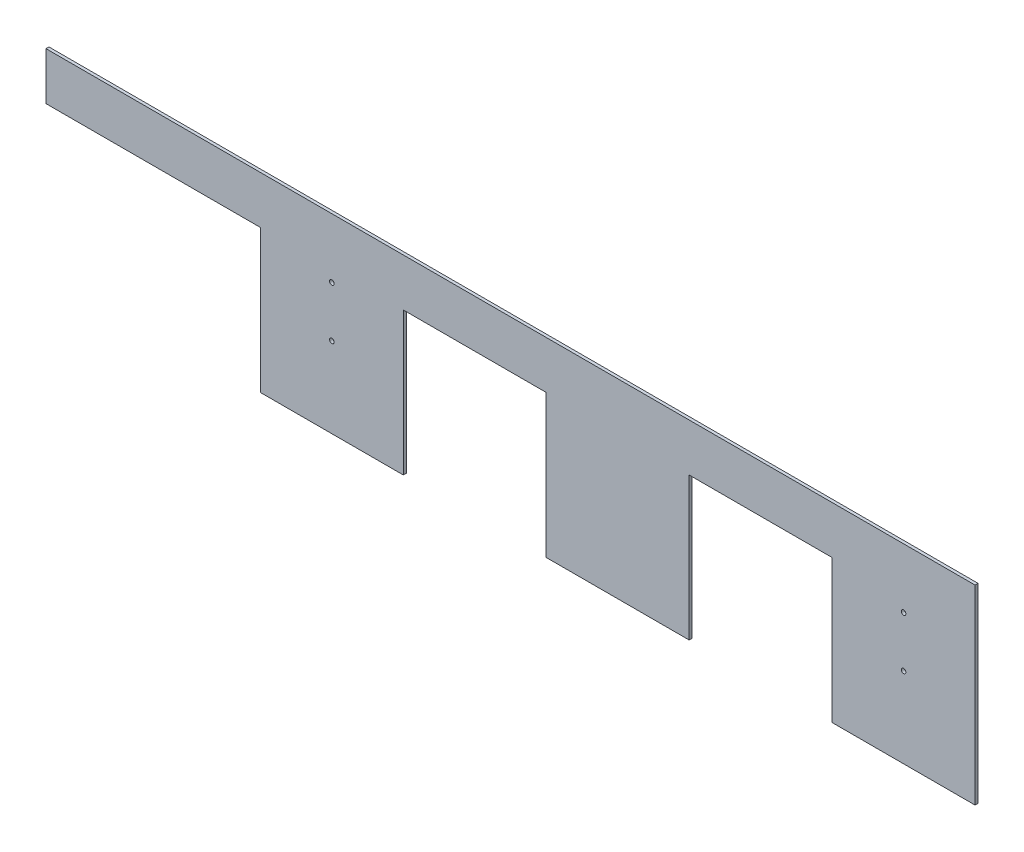
ISO-10303-21;
HEADER;
FILE_DESCRIPTION(('STEP AP214'),'2;1');
FILE_NAME('part.step','',(''),(''),'','','');
FILE_SCHEMA(('AUTOMOTIVE_DESIGN { 1 0 10303 214 1 1 1 1 }'));
ENDSEC;
DATA;
#1=APPLICATION_CONTEXT('core data for automotive mechanical design processes');
#2=APPLICATION_PROTOCOL_DEFINITION('international standard','automotive_design',2000,#1);
#3=PRODUCT_CONTEXT('',#1,'mechanical');
#4=PRODUCT('Part','Part','',(#3));
#5=PRODUCT_RELATED_PRODUCT_CATEGORY('part','',(#4));
#6=PRODUCT_DEFINITION_FORMATION('','',#4);
#7=PRODUCT_DEFINITION_CONTEXT('part definition',#1,'design');
#8=PRODUCT_DEFINITION('design','',#6,#7);
#9=PRODUCT_DEFINITION_SHAPE('','',#8);
#10=(LENGTH_UNIT() NAMED_UNIT(*) SI_UNIT(.MILLI.,.METRE.));
#11=(NAMED_UNIT(*) PLANE_ANGLE_UNIT() SI_UNIT($,.RADIAN.));
#12=(NAMED_UNIT(*) SI_UNIT($,.STERADIAN.) SOLID_ANGLE_UNIT());
#13=UNCERTAINTY_MEASURE_WITH_UNIT(LENGTH_MEASURE(1.E-05),#10,'distance_accuracy_value','');
#14=(GEOMETRIC_REPRESENTATION_CONTEXT(3) GLOBAL_UNCERTAINTY_ASSIGNED_CONTEXT((#13)) GLOBAL_UNIT_ASSIGNED_CONTEXT((#10,
#11,#12)) REPRESENTATION_CONTEXT('',''));
#15=CARTESIAN_POINT('',(0.,0.,0.));
#16=DIRECTION('',(0.,0.,1.));
#17=DIRECTION('',(1.,0.,0.));
#18=AXIS2_PLACEMENT_3D('',#15,#16,#17);
#19=CARTESIAN_POINT('',(0.,0.,3.175));
#20=DIRECTION('',(0.,0.,1.));
#21=DIRECTION('',(1.,0.,0.));
#22=AXIS2_PLACEMENT_3D('',#19,#20,#21);
#23=PLANE('',#22);
#24=CARTESIAN_POINT('',(-190.5,-15.875,3.175));
#25=DIRECTION('',(0.,0.,-1.));
#26=DIRECTION('',(-1.,0.,0.));
#27=AXIS2_PLACEMENT_3D('',#24,#25,#26);
#28=CIRCLE('',#27,2.4384);
#29=CARTESIAN_POINT('',(-192.9384,-15.875,3.175));
#30=VERTEX_POINT('',#29);
#31=EDGE_CURVE('E152',#30,#30,#28,.T.);
#32=ORIENTED_EDGE('',*,*,#31,.T.);
#33=EDGE_LOOP('',(#32));
#34=FACE_BOUND('',#33,.T.);
#35=CARTESIAN_POINT('',(-190.5,38.1,3.175));
#36=DIRECTION('',(0.,0.,-1.));
#37=DIRECTION('',(-1.,0.,0.));
#38=AXIS2_PLACEMENT_3D('',#35,#36,#37);
#39=CIRCLE('',#38,2.4384);
#40=CARTESIAN_POINT('',(-192.9384,38.1,3.175));
#41=VERTEX_POINT('',#40);
#42=EDGE_CURVE('E155',#41,#41,#39,.T.);
#43=ORIENTED_EDGE('',*,*,#42,.T.);
#44=EDGE_LOOP('',(#43));
#45=FACE_BOUND('',#44,.T.);
#46=CARTESIAN_POINT('',(419.1,-15.875,3.175));
#47=DIRECTION('',(0.,0.,-1.));
#48=DIRECTION('',(-1.,0.,0.));
#49=AXIS2_PLACEMENT_3D('',#46,#47,#48);
#50=CIRCLE('',#49,2.4384);
#51=CARTESIAN_POINT('',(416.6616,-15.875,3.175));
#52=VERTEX_POINT('',#51);
#53=EDGE_CURVE('E157',#52,#52,#50,.T.);
#54=ORIENTED_EDGE('',*,*,#53,.T.);
#55=EDGE_LOOP('',(#54));
#56=FACE_BOUND('',#55,.T.);
#57=CARTESIAN_POINT('',(419.1,38.1,3.175));
#58=DIRECTION('',(0.,0.,-1.));
#59=DIRECTION('',(-1.,0.,0.));
#60=AXIS2_PLACEMENT_3D('',#57,#58,#59);
#61=CIRCLE('',#60,2.4384);
#62=CARTESIAN_POINT('',(416.6616,38.1,3.175));
#63=VERTEX_POINT('',#62);
#64=EDGE_CURVE('E20',#63,#63,#61,.T.);
#65=ORIENTED_EDGE('',*,*,#64,.T.);
#66=EDGE_LOOP('',(#65));
#67=FACE_BOUND('',#66,.T.);
#68=DIRECTION('',(0.,1.,0.));
#69=VECTOR('',#68,1.);
#70=CARTESIAN_POINT('',(-495.3,101.6,3.175));
#71=LINE('',#70,#69);
#72=CARTESIAN_POINT('',(-495.3,50.8,3.175));
#73=VERTEX_POINT('',#72);
#74=CARTESIAN_POINT('',(-495.3,101.6,3.175));
#75=VERTEX_POINT('',#74);
#76=EDGE_CURVE('E124',#73,#75,#71,.T.);
#77=ORIENTED_EDGE('',*,*,#76,.F.);
#78=DIRECTION('',(1.,0.,0.));
#79=VECTOR('',#78,1.);
#80=CARTESIAN_POINT('',(-266.7,50.8,3.175));
#81=LINE('',#80,#79);
#82=CARTESIAN_POINT('',(-266.7,50.8,3.175));
#83=VERTEX_POINT('',#82);
#84=EDGE_CURVE('E119',#73,#83,#81,.T.);
#85=ORIENTED_EDGE('',*,*,#84,.T.);
#86=DIRECTION('',(0.,1.,0.));
#87=VECTOR('',#86,1.);
#88=CARTESIAN_POINT('',(-266.7,-101.6,3.175));
#89=LINE('',#88,#87);
#90=CARTESIAN_POINT('',(-266.7,-101.6,3.175));
#91=VERTEX_POINT('',#90);
#92=EDGE_CURVE('E121',#83,#91,#89,.F.);
#93=ORIENTED_EDGE('',*,*,#92,.T.);
#94=DIRECTION('',(1.,0.,0.));
#95=VECTOR('',#94,1.);
#96=CARTESIAN_POINT('',(-495.3,-101.6,3.175));
#97=LINE('',#96,#95);
#98=CARTESIAN_POINT('',(-114.3,-101.6,3.175));
#99=VERTEX_POINT('',#98);
#100=EDGE_CURVE('E114',#99,#91,#97,.F.);
#101=ORIENTED_EDGE('',*,*,#100,.F.);
#102=DIRECTION('',(0.,1.,0.));
#103=VECTOR('',#102,1.);
#104=CARTESIAN_POINT('',(-114.3,50.8,3.175));
#105=LINE('',#104,#103);
#106=CARTESIAN_POINT('',(-114.3,50.8,3.175));
#107=VERTEX_POINT('',#106);
#108=EDGE_CURVE('E214',#99,#107,#105,.T.);
#109=ORIENTED_EDGE('',*,*,#108,.T.);
#110=DIRECTION('',(1.,0.,0.));
#111=VECTOR('',#110,1.);
#112=CARTESIAN_POINT('',(38.1,50.8,3.175));
#113=LINE('',#112,#111);
#114=CARTESIAN_POINT('',(38.1,50.8,3.175));
#115=VERTEX_POINT('',#114);
#116=EDGE_CURVE('E209',#107,#115,#113,.T.);
#117=ORIENTED_EDGE('',*,*,#116,.T.);
#118=DIRECTION('',(0.,1.,0.));
#119=VECTOR('',#118,1.);
#120=CARTESIAN_POINT('',(38.1,-101.6,3.175));
#121=LINE('',#120,#119);
#122=CARTESIAN_POINT('',(38.1,-101.6,3.175));
#123=VERTEX_POINT('',#122);
#124=EDGE_CURVE('E203',#115,#123,#121,.F.);
#125=ORIENTED_EDGE('',*,*,#124,.T.);
#126=DIRECTION('',(1.,0.,0.));
#127=VECTOR('',#126,1.);
#128=CARTESIAN_POINT('',(-495.3,-101.6,3.175));
#129=LINE('',#128,#127);
#130=CARTESIAN_POINT('',(190.5,-101.6,3.175));
#131=VERTEX_POINT('',#130);
#132=EDGE_CURVE('E201',#131,#123,#129,.F.);
#133=ORIENTED_EDGE('',*,*,#132,.F.);
#134=DIRECTION('',(0.,1.,0.));
#135=VECTOR('',#134,1.);
#136=CARTESIAN_POINT('',(190.5,50.8,3.175));
#137=LINE('',#136,#135);
#138=CARTESIAN_POINT('',(190.5,50.8,3.175));
#139=VERTEX_POINT('',#138);
#140=EDGE_CURVE('E194',#131,#139,#137,.T.);
#141=ORIENTED_EDGE('',*,*,#140,.T.);
#142=DIRECTION('',(1.,0.,0.));
#143=VECTOR('',#142,1.);
#144=CARTESIAN_POINT('',(342.9,50.8,3.175));
#145=LINE('',#144,#143);
#146=CARTESIAN_POINT('',(342.9,50.8,3.175));
#147=VERTEX_POINT('',#146);
#148=EDGE_CURVE('E189',#139,#147,#145,.T.);
#149=ORIENTED_EDGE('',*,*,#148,.T.);
#150=DIRECTION('',(0.,1.,0.));
#151=VECTOR('',#150,1.);
#152=CARTESIAN_POINT('',(342.9,-101.6,3.175));
#153=LINE('',#152,#151);
#154=CARTESIAN_POINT('',(342.9,-101.6,3.175));
#155=VERTEX_POINT('',#154);
#156=EDGE_CURVE('E183',#147,#155,#153,.F.);
#157=ORIENTED_EDGE('',*,*,#156,.T.);
#158=DIRECTION('',(1.,0.,0.));
#159=VECTOR('',#158,1.);
#160=CARTESIAN_POINT('',(-495.3,-101.6,3.175));
#161=LINE('',#160,#159);
#162=CARTESIAN_POINT('',(495.3,-101.6,3.175));
#163=VERTEX_POINT('',#162);
#164=EDGE_CURVE('E181',#163,#155,#161,.F.);
#165=ORIENTED_EDGE('',*,*,#164,.F.);
#166=DIRECTION('',(0.,1.,0.));
#167=VECTOR('',#166,1.);
#168=CARTESIAN_POINT('',(495.3,-101.6,3.175));
#169=LINE('',#168,#167);
#170=CARTESIAN_POINT('',(495.3,101.6,3.175));
#171=VERTEX_POINT('',#170);
#172=EDGE_CURVE('E177',#171,#163,#169,.F.);
#173=ORIENTED_EDGE('',*,*,#172,.F.);
#174=DIRECTION('',(1.,0.,0.));
#175=VECTOR('',#174,1.);
#176=CARTESIAN_POINT('',(495.3,101.6,3.175));
#177=LINE('',#176,#175);
#178=EDGE_CURVE('E173',#75,#171,#177,.T.);
#179=ORIENTED_EDGE('',*,*,#178,.F.);
#180=EDGE_LOOP('',(#77,#85,#93,#101,#109,#117,#125,#133,#141,#149,#157,#165,#173,#179));
#181=FACE_BOUND('',#180,.T.);
#182=ADVANCED_FACE('F17',(#34,#45,#56,#67,#181),#23,.T.);
#183=CARTESIAN_POINT('',(-266.7,50.8,3.175));
#184=DIRECTION('',(0.,1.,0.));
#185=DIRECTION('',(0.,0.,1.));
#186=AXIS2_PLACEMENT_3D('',#183,#184,#185);
#187=PLANE('',#186);
#188=ORIENTED_EDGE('',*,*,#84,.F.);
#189=DIRECTION('',(0.,0.,1.));
#190=VECTOR('',#189,1.);
#191=CARTESIAN_POINT('',(-495.3,50.8,0.));
#192=LINE('',#191,#190);
#193=CARTESIAN_POINT('',(-495.3,50.8,0.));
#194=VERTEX_POINT('',#193);
#195=EDGE_CURVE('E162',#194,#73,#192,.T.);
#196=ORIENTED_EDGE('',*,*,#195,.F.);
#197=DIRECTION('',(1.,0.,0.));
#198=VECTOR('',#197,1.);
#199=CARTESIAN_POINT('',(0.,50.8,0.));
#200=LINE('',#199,#198);
#201=CARTESIAN_POINT('',(-266.7,50.8,0.));
#202=VERTEX_POINT('',#201);
#203=EDGE_CURVE('E139',#194,#202,#200,.T.);
#204=ORIENTED_EDGE('',*,*,#203,.T.);
#205=DIRECTION('',(0.,0.,-1.));
#206=VECTOR('',#205,1.);
#207=CARTESIAN_POINT('',(-266.7,50.8,3.175));
#208=LINE('',#207,#206);
#209=EDGE_CURVE('E129',#202,#83,#208,.F.);
#210=ORIENTED_EDGE('',*,*,#209,.T.);
#211=EDGE_LOOP('',(#188,#196,#204,#210));
#212=FACE_BOUND('',#211,.T.);
#213=ADVANCED_FACE('F138',(#212),#187,.F.);
#214=CARTESIAN_POINT('',(-266.7,-101.6,3.175));
#215=DIRECTION('',(1.,0.,0.));
#216=DIRECTION('',(0.,0.,-1.));
#217=AXIS2_PLACEMENT_3D('',#214,#215,#216);
#218=PLANE('',#217);
#219=ORIENTED_EDGE('',*,*,#92,.F.);
#220=ORIENTED_EDGE('',*,*,#209,.F.);
#221=DIRECTION('',(0.,1.,0.));
#222=VECTOR('',#221,1.);
#223=CARTESIAN_POINT('',(-266.7,0.,0.));
#224=LINE('',#223,#222);
#225=CARTESIAN_POINT('',(-266.7,-101.6,0.));
#226=VERTEX_POINT('',#225);
#227=EDGE_CURVE('E226',#202,#226,#224,.F.);
#228=ORIENTED_EDGE('',*,*,#227,.T.);
#229=DIRECTION('',(0.,0.,-1.));
#230=VECTOR('',#229,1.);
#231=CARTESIAN_POINT('',(-266.7,-101.6,0.));
#232=LINE('',#231,#230);
#233=EDGE_CURVE('E135',#91,#226,#232,.T.);
#234=ORIENTED_EDGE('',*,*,#233,.F.);
#235=EDGE_LOOP('',(#219,#220,#228,#234));
#236=FACE_BOUND('',#235,.T.);
#237=ADVANCED_FACE('F132',(#236),#218,.F.);
#238=CARTESIAN_POINT('',(-495.3,-101.6,0.));
#239=DIRECTION('',(0.,-1.,0.));
#240=DIRECTION('',(0.,0.,-1.));
#241=AXIS2_PLACEMENT_3D('',#238,#239,#240);
#242=PLANE('',#241);
#243=ORIENTED_EDGE('',*,*,#100,.T.);
#244=ORIENTED_EDGE('',*,*,#233,.T.);
#245=DIRECTION('',(1.,0.,0.));
#246=VECTOR('',#245,1.);
#247=CARTESIAN_POINT('',(0.,-101.6,0.));
#248=LINE('',#247,#246);
#249=CARTESIAN_POINT('',(-114.3,-101.6,0.));
#250=VERTEX_POINT('',#249);
#251=EDGE_CURVE('E221',#226,#250,#248,.T.);
#252=ORIENTED_EDGE('',*,*,#251,.T.);
#253=DIRECTION('',(0.,0.,1.));
#254=VECTOR('',#253,1.);
#255=CARTESIAN_POINT('',(-114.3,-101.6,3.175));
#256=LINE('',#255,#254);
#257=EDGE_CURVE('E216',#250,#99,#256,.T.);
#258=ORIENTED_EDGE('',*,*,#257,.T.);
#259=EDGE_LOOP('',(#243,#244,#252,#258));
#260=FACE_BOUND('',#259,.T.);
#261=ADVANCED_FACE('F220',(#260),#242,.T.);
#262=CARTESIAN_POINT('',(-114.3,50.8,3.175));
#263=DIRECTION('',(-1.,0.,0.));
#264=DIRECTION('',(0.,0.,1.));
#265=AXIS2_PLACEMENT_3D('',#262,#263,#264);
#266=PLANE('',#265);
#267=ORIENTED_EDGE('',*,*,#108,.F.);
#268=ORIENTED_EDGE('',*,*,#257,.F.);
#269=DIRECTION('',(0.,1.,0.));
#270=VECTOR('',#269,1.);
#271=CARTESIAN_POINT('',(-114.3,0.,0.));
#272=LINE('',#271,#270);
#273=CARTESIAN_POINT('',(-114.3,50.8,0.));
#274=VERTEX_POINT('',#273);
#275=EDGE_CURVE('E229',#250,#274,#272,.T.);
#276=ORIENTED_EDGE('',*,*,#275,.T.);
#277=DIRECTION('',(0.,0.,1.));
#278=VECTOR('',#277,1.);
#279=CARTESIAN_POINT('',(-114.3,50.8,3.175));
#280=LINE('',#279,#278);
#281=EDGE_CURVE('E211',#274,#107,#280,.T.);
#282=ORIENTED_EDGE('',*,*,#281,.T.);
#283=EDGE_LOOP('',(#267,#268,#276,#282));
#284=FACE_BOUND('',#283,.T.);
#285=ADVANCED_FACE('F299',(#284),#266,.F.);
#286=CARTESIAN_POINT('',(38.1,50.8,3.175));
#287=DIRECTION('',(0.,1.,0.));
#288=DIRECTION('',(0.,0.,1.));
#289=AXIS2_PLACEMENT_3D('',#286,#287,#288);
#290=PLANE('',#289);
#291=ORIENTED_EDGE('',*,*,#116,.F.);
#292=ORIENTED_EDGE('',*,*,#281,.F.);
#293=DIRECTION('',(1.,0.,0.));
#294=VECTOR('',#293,1.);
#295=CARTESIAN_POINT('',(0.,50.8,0.));
#296=LINE('',#295,#294);
#297=CARTESIAN_POINT('',(38.1,50.8,0.));
#298=VERTEX_POINT('',#297);
#299=EDGE_CURVE('E233',#274,#298,#296,.T.);
#300=ORIENTED_EDGE('',*,*,#299,.T.);
#301=DIRECTION('',(0.,0.,-1.));
#302=VECTOR('',#301,1.);
#303=CARTESIAN_POINT('',(38.1,50.8,3.175));
#304=LINE('',#303,#302);
#305=EDGE_CURVE('E206',#298,#115,#304,.F.);
#306=ORIENTED_EDGE('',*,*,#305,.T.);
#307=EDGE_LOOP('',(#291,#292,#300,#306));
#308=FACE_BOUND('',#307,.T.);
#309=ADVANCED_FACE('F296',(#308),#290,.F.);
#310=CARTESIAN_POINT('',(38.1,-101.6,3.175));
#311=DIRECTION('',(1.,0.,0.));
#312=DIRECTION('',(0.,0.,-1.));
#313=AXIS2_PLACEMENT_3D('',#310,#311,#312);
#314=PLANE('',#313);
#315=ORIENTED_EDGE('',*,*,#124,.F.);
#316=ORIENTED_EDGE('',*,*,#305,.F.);
#317=DIRECTION('',(0.,1.,0.));
#318=VECTOR('',#317,1.);
#319=CARTESIAN_POINT('',(38.1,0.,0.));
#320=LINE('',#319,#318);
#321=CARTESIAN_POINT('',(38.1,-101.6,0.));
#322=VERTEX_POINT('',#321);
#323=EDGE_CURVE('E236',#298,#322,#320,.F.);
#324=ORIENTED_EDGE('',*,*,#323,.T.);
#325=DIRECTION('',(0.,0.,-1.));
#326=VECTOR('',#325,1.);
#327=CARTESIAN_POINT('',(38.1,-101.6,0.));
#328=LINE('',#327,#326);
#329=EDGE_CURVE('E199',#123,#322,#328,.T.);
#330=ORIENTED_EDGE('',*,*,#329,.F.);
#331=EDGE_LOOP('',(#315,#316,#324,#330));
#332=FACE_BOUND('',#331,.T.);
#333=ADVANCED_FACE('F293',(#332),#314,.F.);
#334=CARTESIAN_POINT('',(-495.3,-101.6,0.));
#335=DIRECTION('',(0.,-1.,0.));
#336=DIRECTION('',(0.,0.,-1.));
#337=AXIS2_PLACEMENT_3D('',#334,#335,#336);
#338=PLANE('',#337);
#339=ORIENTED_EDGE('',*,*,#132,.T.);
#340=ORIENTED_EDGE('',*,*,#329,.T.);
#341=DIRECTION('',(1.,0.,0.));
#342=VECTOR('',#341,1.);
#343=CARTESIAN_POINT('',(0.,-101.6,0.));
#344=LINE('',#343,#342);
#345=CARTESIAN_POINT('',(190.5,-101.6,0.));
#346=VERTEX_POINT('',#345);
#347=EDGE_CURVE('E239',#322,#346,#344,.T.);
#348=ORIENTED_EDGE('',*,*,#347,.T.);
#349=DIRECTION('',(0.,0.,1.));
#350=VECTOR('',#349,1.);
#351=CARTESIAN_POINT('',(190.5,-101.6,3.175));
#352=LINE('',#351,#350);
#353=EDGE_CURVE('E196',#346,#131,#352,.T.);
#354=ORIENTED_EDGE('',*,*,#353,.T.);
#355=EDGE_LOOP('',(#339,#340,#348,#354));
#356=FACE_BOUND('',#355,.T.);
#357=ADVANCED_FACE('F289',(#356),#338,.T.);
#358=CARTESIAN_POINT('',(190.5,50.8,3.175));
#359=DIRECTION('',(-1.,0.,0.));
#360=DIRECTION('',(0.,0.,1.));
#361=AXIS2_PLACEMENT_3D('',#358,#359,#360);
#362=PLANE('',#361);
#363=ORIENTED_EDGE('',*,*,#140,.F.);
#364=ORIENTED_EDGE('',*,*,#353,.F.);
#365=DIRECTION('',(0.,1.,0.));
#366=VECTOR('',#365,1.);
#367=CARTESIAN_POINT('',(190.5,0.,0.));
#368=LINE('',#367,#366);
#369=CARTESIAN_POINT('',(190.5,50.8,0.));
#370=VERTEX_POINT('',#369);
#371=EDGE_CURVE('E242',#346,#370,#368,.T.);
#372=ORIENTED_EDGE('',*,*,#371,.T.);
#373=DIRECTION('',(0.,0.,1.));
#374=VECTOR('',#373,1.);
#375=CARTESIAN_POINT('',(190.5,50.8,3.175));
#376=LINE('',#375,#374);
#377=EDGE_CURVE('E191',#370,#139,#376,.T.);
#378=ORIENTED_EDGE('',*,*,#377,.T.);
#379=EDGE_LOOP('',(#363,#364,#372,#378));
#380=FACE_BOUND('',#379,.T.);
#381=ADVANCED_FACE('F285',(#380),#362,.F.);
#382=CARTESIAN_POINT('',(342.9,50.8,3.175));
#383=DIRECTION('',(0.,1.,0.));
#384=DIRECTION('',(0.,0.,1.));
#385=AXIS2_PLACEMENT_3D('',#382,#383,#384);
#386=PLANE('',#385);
#387=ORIENTED_EDGE('',*,*,#148,.F.);
#388=ORIENTED_EDGE('',*,*,#377,.F.);
#389=DIRECTION('',(1.,0.,0.));
#390=VECTOR('',#389,1.);
#391=CARTESIAN_POINT('',(0.,50.8,0.));
#392=LINE('',#391,#390);
#393=CARTESIAN_POINT('',(342.9,50.8,0.));
#394=VERTEX_POINT('',#393);
#395=EDGE_CURVE('E245',#370,#394,#392,.T.);
#396=ORIENTED_EDGE('',*,*,#395,.T.);
#397=DIRECTION('',(0.,0.,-1.));
#398=VECTOR('',#397,1.);
#399=CARTESIAN_POINT('',(342.9,50.8,3.175));
#400=LINE('',#399,#398);
#401=EDGE_CURVE('E186',#394,#147,#400,.F.);
#402=ORIENTED_EDGE('',*,*,#401,.T.);
#403=EDGE_LOOP('',(#387,#388,#396,#402));
#404=FACE_BOUND('',#403,.T.);
#405=ADVANCED_FACE('F282',(#404),#386,.F.);
#406=CARTESIAN_POINT('',(342.9,-101.6,3.175));
#407=DIRECTION('',(1.,0.,0.));
#408=DIRECTION('',(0.,0.,-1.));
#409=AXIS2_PLACEMENT_3D('',#406,#407,#408);
#410=PLANE('',#409);
#411=ORIENTED_EDGE('',*,*,#156,.F.);
#412=ORIENTED_EDGE('',*,*,#401,.F.);
#413=DIRECTION('',(0.,1.,0.));
#414=VECTOR('',#413,1.);
#415=CARTESIAN_POINT('',(342.9,0.,0.));
#416=LINE('',#415,#414);
#417=CARTESIAN_POINT('',(342.9,-101.6,0.));
#418=VERTEX_POINT('',#417);
#419=EDGE_CURVE('E248',#394,#418,#416,.F.);
#420=ORIENTED_EDGE('',*,*,#419,.T.);
#421=DIRECTION('',(0.,0.,-1.));
#422=VECTOR('',#421,1.);
#423=CARTESIAN_POINT('',(342.9,-101.6,0.));
#424=LINE('',#423,#422);
#425=EDGE_CURVE('E179',#155,#418,#424,.T.);
#426=ORIENTED_EDGE('',*,*,#425,.F.);
#427=EDGE_LOOP('',(#411,#412,#420,#426));
#428=FACE_BOUND('',#427,.T.);
#429=ADVANCED_FACE('F277',(#428),#410,.F.);
#430=CARTESIAN_POINT('',(-495.3,-101.6,0.));
#431=DIRECTION('',(0.,-1.,0.));
#432=DIRECTION('',(0.,0.,-1.));
#433=AXIS2_PLACEMENT_3D('',#430,#431,#432);
#434=PLANE('',#433);
#435=ORIENTED_EDGE('',*,*,#164,.T.);
#436=ORIENTED_EDGE('',*,*,#425,.T.);
#437=DIRECTION('',(1.,0.,0.));
#438=VECTOR('',#437,1.);
#439=CARTESIAN_POINT('',(0.,-101.6,0.));
#440=LINE('',#439,#438);
#441=CARTESIAN_POINT('',(495.3,-101.6,0.));
#442=VERTEX_POINT('',#441);
#443=EDGE_CURVE('E251',#418,#442,#440,.T.);
#444=ORIENTED_EDGE('',*,*,#443,.T.);
#445=DIRECTION('',(0.,0.,-1.));
#446=VECTOR('',#445,1.);
#447=CARTESIAN_POINT('',(495.3,-101.6,0.));
#448=LINE('',#447,#446);
#449=EDGE_CURVE('E175',#163,#442,#448,.T.);
#450=ORIENTED_EDGE('',*,*,#449,.F.);
#451=EDGE_LOOP('',(#435,#436,#444,#450));
#452=FACE_BOUND('',#451,.T.);
#453=ADVANCED_FACE('F273',(#452),#434,.T.);
#454=CARTESIAN_POINT('',(495.3,-101.6,0.));
#455=DIRECTION('',(1.,0.,0.));
#456=DIRECTION('',(0.,0.,-1.));
#457=AXIS2_PLACEMENT_3D('',#454,#455,#456);
#458=PLANE('',#457);
#459=ORIENTED_EDGE('',*,*,#449,.T.);
#460=DIRECTION('',(0.,1.,0.));
#461=VECTOR('',#460,1.);
#462=CARTESIAN_POINT('',(495.3,0.,0.));
#463=LINE('',#462,#461);
#464=CARTESIAN_POINT('',(495.3,101.6,0.));
#465=VERTEX_POINT('',#464);
#466=EDGE_CURVE('E254',#442,#465,#463,.T.);
#467=ORIENTED_EDGE('',*,*,#466,.T.);
#468=DIRECTION('',(0.,0.,1.));
#469=VECTOR('',#468,1.);
#470=CARTESIAN_POINT('',(495.3,101.6,0.));
#471=LINE('',#470,#469);
#472=EDGE_CURVE('E171',#171,#465,#471,.F.);
#473=ORIENTED_EDGE('',*,*,#472,.F.);
#474=ORIENTED_EDGE('',*,*,#172,.T.);
#475=EDGE_LOOP('',(#459,#467,#473,#474));
#476=FACE_BOUND('',#475,.T.);
#477=ADVANCED_FACE('F267',(#476),#458,.T.);
#478=CARTESIAN_POINT('',(495.3,101.6,0.));
#479=DIRECTION('',(0.,1.,0.));
#480=DIRECTION('',(0.,0.,1.));
#481=AXIS2_PLACEMENT_3D('',#478,#479,#480);
#482=PLANE('',#481);
#483=ORIENTED_EDGE('',*,*,#472,.T.);
#484=DIRECTION('',(1.,0.,0.));
#485=VECTOR('',#484,1.);
#486=CARTESIAN_POINT('',(0.,101.6,0.));
#487=LINE('',#486,#485);
#488=CARTESIAN_POINT('',(-495.3,101.6,0.));
#489=VERTEX_POINT('',#488);
#490=EDGE_CURVE('E257',#465,#489,#487,.F.);
#491=ORIENTED_EDGE('',*,*,#490,.T.);
#492=DIRECTION('',(0.,0.,1.));
#493=VECTOR('',#492,1.);
#494=CARTESIAN_POINT('',(-495.3,101.6,0.));
#495=LINE('',#494,#493);
#496=EDGE_CURVE('E35',#75,#489,#495,.F.);
#497=ORIENTED_EDGE('',*,*,#496,.F.);
#498=ORIENTED_EDGE('',*,*,#178,.T.);
#499=EDGE_LOOP('',(#483,#491,#497,#498));
#500=FACE_BOUND('',#499,.T.);
#501=ADVANCED_FACE('F263',(#500),#482,.T.);
#502=CARTESIAN_POINT('',(-495.3,101.6,0.));
#503=DIRECTION('',(-1.,0.,0.));
#504=DIRECTION('',(0.,0.,1.));
#505=AXIS2_PLACEMENT_3D('',#502,#503,#504);
#506=PLANE('',#505);
#507=DIRECTION('',(0.,1.,0.));
#508=VECTOR('',#507,1.);
#509=CARTESIAN_POINT('',(-495.3,0.,0.));
#510=LINE('',#509,#508);
#511=EDGE_CURVE('E151',#489,#194,#510,.F.);
#512=ORIENTED_EDGE('',*,*,#511,.T.);
#513=ORIENTED_EDGE('',*,*,#195,.T.);
#514=ORIENTED_EDGE('',*,*,#76,.T.);
#515=ORIENTED_EDGE('',*,*,#496,.T.);
#516=EDGE_LOOP('',(#512,#513,#514,#515));
#517=FACE_BOUND('',#516,.T.);
#518=ADVANCED_FACE('F260',(#517),#506,.T.);
#519=CARTESIAN_POINT('',(419.1,38.1,3.175));
#520=DIRECTION('',(0.,0.,-1.));
#521=DIRECTION('',(-1.,0.,0.));
#522=AXIS2_PLACEMENT_3D('',#519,#520,#521);
#523=CYLINDRICAL_SURFACE('',#522,2.4384);
#524=ORIENTED_EDGE('',*,*,#64,.F.);
#525=EDGE_LOOP('',(#524));
#526=FACE_BOUND('',#525,.T.);
#527=CARTESIAN_POINT('',(419.1,38.1,0.));
#528=DIRECTION('',(0.,0.,-1.));
#529=DIRECTION('',(-1.,0.,0.));
#530=AXIS2_PLACEMENT_3D('',#527,#528,#529);
#531=CIRCLE('',#530,2.4384);
#532=CARTESIAN_POINT('',(416.6616,38.1,0.));
#533=VERTEX_POINT('',#532);
#534=EDGE_CURVE('E148',#533,#533,#531,.T.);
#535=ORIENTED_EDGE('',*,*,#534,.T.);
#536=EDGE_LOOP('',(#535));
#537=FACE_BOUND('',#536,.T.);
#538=ADVANCED_FACE('F328',(#526,#537),#523,.F.);
#539=CARTESIAN_POINT('',(419.1,-15.875,3.175));
#540=DIRECTION('',(0.,0.,-1.));
#541=DIRECTION('',(-1.,0.,0.));
#542=AXIS2_PLACEMENT_3D('',#539,#540,#541);
#543=CYLINDRICAL_SURFACE('',#542,2.4384);
#544=ORIENTED_EDGE('',*,*,#53,.F.);
#545=EDGE_LOOP('',(#544));
#546=FACE_BOUND('',#545,.T.);
#547=CARTESIAN_POINT('',(419.1,-15.875,0.));
#548=DIRECTION('',(0.,0.,-1.));
#549=DIRECTION('',(-1.,0.,0.));
#550=AXIS2_PLACEMENT_3D('',#547,#548,#549);
#551=CIRCLE('',#550,2.4384);
#552=CARTESIAN_POINT('',(416.6616,-15.875,0.));
#553=VERTEX_POINT('',#552);
#554=EDGE_CURVE('E145',#553,#553,#551,.T.);
#555=ORIENTED_EDGE('',*,*,#554,.T.);
#556=EDGE_LOOP('',(#555));
#557=FACE_BOUND('',#556,.T.);
#558=ADVANCED_FACE('F324',(#546,#557),#543,.F.);
#559=CARTESIAN_POINT('',(-190.5,38.1,3.175));
#560=DIRECTION('',(0.,0.,-1.));
#561=DIRECTION('',(-1.,0.,0.));
#562=AXIS2_PLACEMENT_3D('',#559,#560,#561);
#563=CYLINDRICAL_SURFACE('',#562,2.4384);
#564=ORIENTED_EDGE('',*,*,#42,.F.);
#565=EDGE_LOOP('',(#564));
#566=FACE_BOUND('',#565,.T.);
#567=CARTESIAN_POINT('',(-190.5,38.1,0.));
#568=DIRECTION('',(0.,0.,-1.));
#569=DIRECTION('',(-1.,0.,0.));
#570=AXIS2_PLACEMENT_3D('',#567,#568,#569);
#571=CIRCLE('',#570,2.4384);
#572=CARTESIAN_POINT('',(-192.9384,38.1,0.));
#573=VERTEX_POINT('',#572);
#574=EDGE_CURVE('E26',#573,#573,#571,.T.);
#575=ORIENTED_EDGE('',*,*,#574,.T.);
#576=EDGE_LOOP('',(#575));
#577=FACE_BOUND('',#576,.T.);
#578=ADVANCED_FACE('F316',(#566,#577),#563,.F.);
#579=CARTESIAN_POINT('',(-190.5,-15.875,3.175));
#580=DIRECTION('',(0.,0.,-1.));
#581=DIRECTION('',(-1.,0.,0.));
#582=AXIS2_PLACEMENT_3D('',#579,#580,#581);
#583=CYLINDRICAL_SURFACE('',#582,2.4384);
#584=ORIENTED_EDGE('',*,*,#31,.F.);
#585=EDGE_LOOP('',(#584));
#586=FACE_BOUND('',#585,.T.);
#587=CARTESIAN_POINT('',(-190.5,-15.875,0.));
#588=DIRECTION('',(0.,0.,-1.));
#589=DIRECTION('',(-1.,0.,0.));
#590=AXIS2_PLACEMENT_3D('',#587,#588,#589);
#591=CIRCLE('',#590,2.4384);
#592=CARTESIAN_POINT('',(-192.9384,-15.875,0.));
#593=VERTEX_POINT('',#592);
#594=EDGE_CURVE('E11',#593,#593,#591,.T.);
#595=ORIENTED_EDGE('',*,*,#594,.T.);
#596=EDGE_LOOP('',(#595));
#597=FACE_BOUND('',#596,.T.);
#598=ADVANCED_FACE('F310',(#586,#597),#583,.F.);
#599=CARTESIAN_POINT('',(0.,0.,0.));
#600=DIRECTION('',(0.,0.,1.));
#601=DIRECTION('',(1.,0.,0.));
#602=AXIS2_PLACEMENT_3D('',#599,#600,#601);
#603=PLANE('',#602);
#604=ORIENTED_EDGE('',*,*,#594,.F.);
#605=EDGE_LOOP('',(#604));
#606=FACE_BOUND('',#605,.T.);
#607=ORIENTED_EDGE('',*,*,#574,.F.);
#608=EDGE_LOOP('',(#607));
#609=FACE_BOUND('',#608,.T.);
#610=ORIENTED_EDGE('',*,*,#554,.F.);
#611=EDGE_LOOP('',(#610));
#612=FACE_BOUND('',#611,.T.);
#613=ORIENTED_EDGE('',*,*,#534,.F.);
#614=EDGE_LOOP('',(#613));
#615=FACE_BOUND('',#614,.T.);
#616=ORIENTED_EDGE('',*,*,#490,.F.);
#617=ORIENTED_EDGE('',*,*,#466,.F.);
#618=ORIENTED_EDGE('',*,*,#443,.F.);
#619=ORIENTED_EDGE('',*,*,#419,.F.);
#620=ORIENTED_EDGE('',*,*,#395,.F.);
#621=ORIENTED_EDGE('',*,*,#371,.F.);
#622=ORIENTED_EDGE('',*,*,#347,.F.);
#623=ORIENTED_EDGE('',*,*,#323,.F.);
#624=ORIENTED_EDGE('',*,*,#299,.F.);
#625=ORIENTED_EDGE('',*,*,#275,.F.);
#626=ORIENTED_EDGE('',*,*,#251,.F.);
#627=ORIENTED_EDGE('',*,*,#227,.F.);
#628=ORIENTED_EDGE('',*,*,#203,.F.);
#629=ORIENTED_EDGE('',*,*,#511,.F.);
#630=EDGE_LOOP('',(#616,#617,#618,#619,#620,#621,#622,#623,#624,#625,#626,#627,#628,#629));
#631=FACE_BOUND('',#630,.T.);
#632=ADVANCED_FACE('F225',(#606,#609,#612,#615,#631),#603,.F.);
#633=CLOSED_SHELL('',(#182,#213,#237,#261,#285,#309,#333,#357,#381,#405,#429,#453,#477,#501,
#518,#538,#558,#578,#598,#632));
#634=MANIFOLD_SOLID_BREP('B1',#633);
#635=ADVANCED_BREP_SHAPE_REPRESENTATION('',(#18,#634),#14);
#636=SHAPE_DEFINITION_REPRESENTATION(#9,#635);
ENDSEC;
END-ISO-10303-21;
